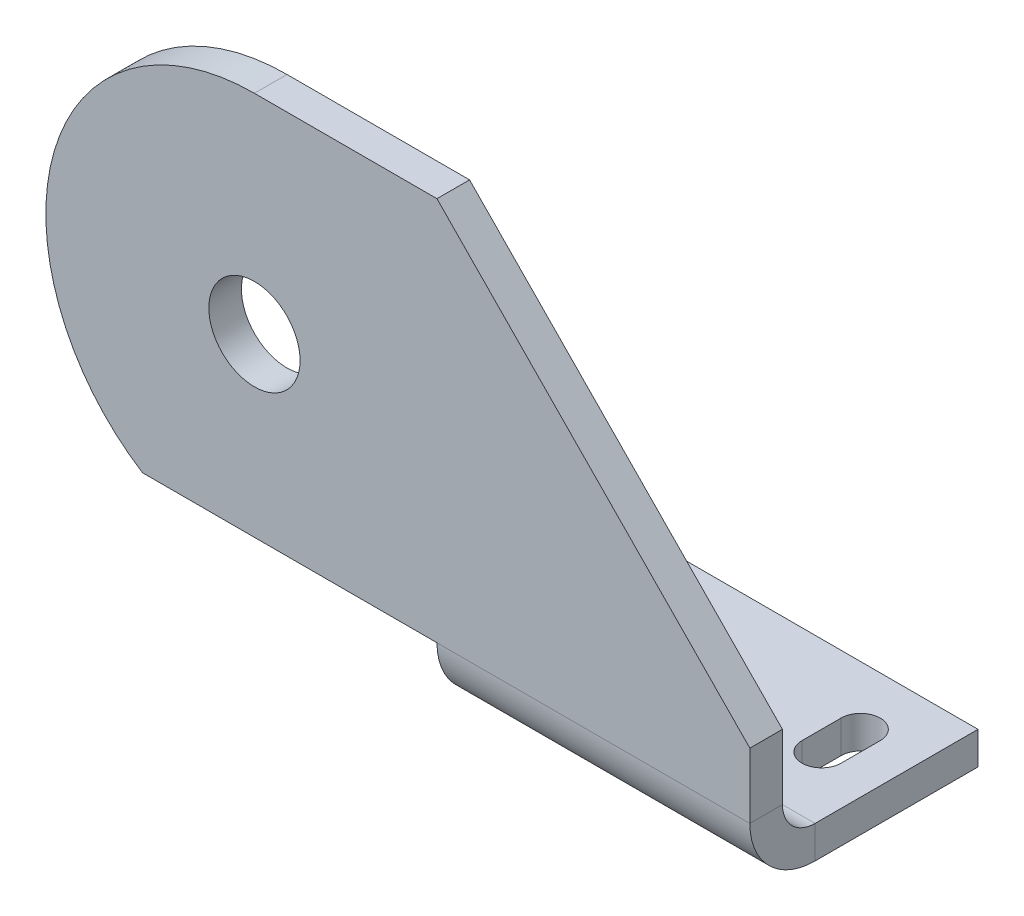
ISO-10303-21;
HEADER;
FILE_DESCRIPTION(('STEP AP214'),'2;1');
FILE_NAME('part.step','',(''),(''),'','','');
FILE_SCHEMA(('AUTOMOTIVE_DESIGN { 1 0 10303 214 1 1 1 1 }'));
ENDSEC;
DATA;
#1=APPLICATION_CONTEXT('core data for automotive mechanical design processes');
#2=APPLICATION_PROTOCOL_DEFINITION('international standard','automotive_design',2000,#1);
#3=PRODUCT_CONTEXT('',#1,'mechanical');
#4=PRODUCT('Part','Part','',(#3));
#5=PRODUCT_RELATED_PRODUCT_CATEGORY('part','',(#4));
#6=PRODUCT_DEFINITION_FORMATION('','',#4);
#7=PRODUCT_DEFINITION_CONTEXT('part definition',#1,'design');
#8=PRODUCT_DEFINITION('design','',#6,#7);
#9=PRODUCT_DEFINITION_SHAPE('','',#8);
#10=(LENGTH_UNIT() NAMED_UNIT(*) SI_UNIT(.MILLI.,.METRE.));
#11=(NAMED_UNIT(*) PLANE_ANGLE_UNIT() SI_UNIT($,.RADIAN.));
#12=(NAMED_UNIT(*) SI_UNIT($,.STERADIAN.) SOLID_ANGLE_UNIT());
#13=UNCERTAINTY_MEASURE_WITH_UNIT(LENGTH_MEASURE(1.E-05),#10,'distance_accuracy_value','');
#14=(GEOMETRIC_REPRESENTATION_CONTEXT(3) GLOBAL_UNCERTAINTY_ASSIGNED_CONTEXT((#13)) GLOBAL_UNIT_ASSIGNED_CONTEXT((#10,
#11,#12)) REPRESENTATION_CONTEXT('',''));
#15=CARTESIAN_POINT('',(0.,0.,0.));
#16=DIRECTION('',(0.,0.,1.));
#17=DIRECTION('',(1.,0.,0.));
#18=AXIS2_PLACEMENT_3D('',#15,#16,#17);
#19=CARTESIAN_POINT('',(-108.,0.,5.));
#20=DIRECTION('',(0.,0.,-1.));
#21=DIRECTION('',(-1.,0.,0.));
#22=AXIS2_PLACEMENT_3D('',#19,#20,#21);
#23=PLANE('',#22);
#24=CARTESIAN_POINT('',(-76.,32.,5.));
#25=DIRECTION('',(0.,0.,1.));
#26=DIRECTION('',(1.,0.,0.));
#27=AXIS2_PLACEMENT_3D('',#24,#25,#26);
#28=CIRCLE('',#27,7.);
#29=CARTESIAN_POINT('',(-69.,32.,5.));
#30=VERTEX_POINT('',#29);
#31=EDGE_CURVE('E187',#30,#30,#28,.T.);
#32=ORIENTED_EDGE('',*,*,#31,.F.);
#33=EDGE_LOOP('',(#32));
#34=FACE_BOUND('',#33,.T.);
#35=DIRECTION('',(0.699779834816443,-0.714358581375119,0.));
#36=VECTOR('',#35,1.);
#37=CARTESIAN_POINT('',(0.,15.,5.));
#38=LINE('',#37,#36);
#39=CARTESIAN_POINT('',(-48.,64.,5.));
#40=VERTEX_POINT('',#39);
#41=CARTESIAN_POINT('',(0.,15.,5.));
#42=VERTEX_POINT('',#41);
#43=EDGE_CURVE('E229',#40,#42,#38,.T.);
#44=ORIENTED_EDGE('',*,*,#43,.F.);
#45=DIRECTION('',(1.,0.,0.));
#46=VECTOR('',#45,1.);
#47=CARTESIAN_POINT('',(-108.,64.,5.));
#48=LINE('',#47,#46);
#49=CARTESIAN_POINT('',(-76.,64.,5.));
#50=VERTEX_POINT('',#49);
#51=EDGE_CURVE('E305',#50,#40,#48,.T.);
#52=ORIENTED_EDGE('',*,*,#51,.F.);
#53=CARTESIAN_POINT('',(-76.,32.,5.));
#54=DIRECTION('',(0.,0.,-1.));
#55=DIRECTION('',(1.,0.,0.));
#56=AXIS2_PLACEMENT_3D('',#53,#54,#55);
#57=CIRCLE('',#56,32.);
#58=CARTESIAN_POINT('',(-93.1755640373177,5.,5.));
#59=VERTEX_POINT('',#58);
#60=EDGE_CURVE('E248',#59,#50,#57,.T.);
#61=ORIENTED_EDGE('',*,*,#60,.F.);
#62=DIRECTION('',(1.,0.,0.));
#63=VECTOR('',#62,1.);
#64=CARTESIAN_POINT('',(-108.,5.,5.));
#65=LINE('',#64,#63);
#66=CARTESIAN_POINT('',(-48.,5.,5.));
#67=VERTEX_POINT('',#66);
#68=EDGE_CURVE('E289',#59,#67,#65,.T.);
#69=ORIENTED_EDGE('',*,*,#68,.T.);
#70=CARTESIAN_POINT('',(0.,5.,5.));
#71=VERTEX_POINT('',#70);
#72=EDGE_CURVE('E288',#67,#71,#65,.T.);
#73=ORIENTED_EDGE('',*,*,#72,.T.);
#74=DIRECTION('',(0.,1.,0.));
#75=VECTOR('',#74,1.);
#76=CARTESIAN_POINT('',(0.,0.,5.));
#77=LINE('',#76,#75);
#78=EDGE_CURVE('E267',#71,#42,#77,.T.);
#79=ORIENTED_EDGE('',*,*,#78,.T.);
#80=EDGE_LOOP('',(#44,#52,#61,#69,#73,#79));
#81=FACE_BOUND('',#80,.T.);
#82=ADVANCED_FACE('F38',(#34,#81),#23,.F.);
#83=CARTESIAN_POINT('',(-108.,0.,0.));
#84=DIRECTION('',(0.,0.,-1.));
#85=DIRECTION('',(-1.,0.,0.));
#86=AXIS2_PLACEMENT_3D('',#83,#84,#85);
#87=PLANE('',#86);
#88=CARTESIAN_POINT('',(-76.,32.,0.));
#89=DIRECTION('',(0.,0.,1.));
#90=DIRECTION('',(1.,0.,0.));
#91=AXIS2_PLACEMENT_3D('',#88,#89,#90);
#92=CIRCLE('',#91,7.);
#93=CARTESIAN_POINT('',(-69.,32.,0.));
#94=VERTEX_POINT('',#93);
#95=EDGE_CURVE('E194',#94,#94,#92,.T.);
#96=ORIENTED_EDGE('',*,*,#95,.T.);
#97=EDGE_LOOP('',(#96));
#98=FACE_BOUND('',#97,.T.);
#99=DIRECTION('',(1.,0.,0.));
#100=VECTOR('',#99,1.);
#101=CARTESIAN_POINT('',(-108.,64.,0.));
#102=LINE('',#101,#100);
#103=CARTESIAN_POINT('',(-76.,64.,0.));
#104=VERTEX_POINT('',#103);
#105=CARTESIAN_POINT('',(-48.,64.,0.));
#106=VERTEX_POINT('',#105);
#107=EDGE_CURVE('E302',#104,#106,#102,.T.);
#108=ORIENTED_EDGE('',*,*,#107,.T.);
#109=DIRECTION('',(0.699779834816443,-0.714358581375119,0.));
#110=VECTOR('',#109,1.);
#111=CARTESIAN_POINT('',(0.,15.,0.));
#112=LINE('',#111,#110);
#113=CARTESIAN_POINT('',(0.,15.,0.));
#114=VERTEX_POINT('',#113);
#115=EDGE_CURVE('E236',#106,#114,#112,.T.);
#116=ORIENTED_EDGE('',*,*,#115,.T.);
#117=DIRECTION('',(0.,1.,0.));
#118=VECTOR('',#117,1.);
#119=CARTESIAN_POINT('',(0.,0.,0.));
#120=LINE('',#119,#118);
#121=CARTESIAN_POINT('',(0.,5.,0.));
#122=VERTEX_POINT('',#121);
#123=EDGE_CURVE('E270',#122,#114,#120,.T.);
#124=ORIENTED_EDGE('',*,*,#123,.F.);
#125=DIRECTION('',(1.,0.,0.));
#126=VECTOR('',#125,1.);
#127=CARTESIAN_POINT('',(-108.,5.,0.));
#128=LINE('',#127,#126);
#129=CARTESIAN_POINT('',(-48.,5.,0.));
#130=VERTEX_POINT('',#129);
#131=EDGE_CURVE('E299',#130,#122,#128,.T.);
#132=ORIENTED_EDGE('',*,*,#131,.F.);
#133=CARTESIAN_POINT('',(-93.1755640373177,5.,0.));
#134=VERTEX_POINT('',#133);
#135=EDGE_CURVE('E300',#134,#130,#128,.T.);
#136=ORIENTED_EDGE('',*,*,#135,.F.);
#137=CARTESIAN_POINT('',(-76.,32.,0.));
#138=DIRECTION('',(0.,0.,-1.));
#139=DIRECTION('',(-1.,0.,0.));
#140=AXIS2_PLACEMENT_3D('',#137,#138,#139);
#141=CIRCLE('',#140,32.);
#142=EDGE_CURVE('E249',#134,#104,#141,.T.);
#143=ORIENTED_EDGE('',*,*,#142,.T.);
#144=EDGE_LOOP('',(#108,#116,#124,#132,#136,#143));
#145=FACE_BOUND('',#144,.T.);
#146=ADVANCED_FACE('F357',(#98,#145),#87,.T.);
#147=CARTESIAN_POINT('',(-108.,64.,0.));
#148=DIRECTION('',(0.,1.,0.));
#149=DIRECTION('',(0.,0.,1.));
#150=AXIS2_PLACEMENT_3D('',#147,#148,#149);
#151=PLANE('',#150);
#152=ORIENTED_EDGE('',*,*,#51,.T.);
#153=DIRECTION('',(0.,0.,1.));
#154=VECTOR('',#153,1.);
#155=CARTESIAN_POINT('',(-48.,64.,5.));
#156=LINE('',#155,#154);
#157=EDGE_CURVE('E241',#40,#106,#156,.F.);
#158=ORIENTED_EDGE('',*,*,#157,.T.);
#159=ORIENTED_EDGE('',*,*,#107,.F.);
#160=DIRECTION('',(0.,0.,1.));
#161=VECTOR('',#160,1.);
#162=CARTESIAN_POINT('',(-76.,64.,5.));
#163=LINE('',#162,#161);
#164=EDGE_CURVE('E244',#50,#104,#163,.F.);
#165=ORIENTED_EDGE('',*,*,#164,.F.);
#166=EDGE_LOOP('',(#152,#158,#159,#165));
#167=FACE_BOUND('',#166,.T.);
#168=ADVANCED_FACE('F362',(#167),#151,.T.);
#169=CARTESIAN_POINT('',(0.,5.,-5.));
#170=DIRECTION('',(1.,0.,0.));
#171=DIRECTION('',(0.,0.,-1.));
#172=AXIS2_PLACEMENT_3D('',#169,#170,#171);
#173=PLANE('',#172);
#174=ORIENTED_EDGE('',*,*,#123,.T.);
#175=DIRECTION('',(0.,0.,1.));
#176=VECTOR('',#175,1.);
#177=CARTESIAN_POINT('',(0.,15.,5.));
#178=LINE('',#177,#176);
#179=EDGE_CURVE('E239',#42,#114,#178,.F.);
#180=ORIENTED_EDGE('',*,*,#179,.F.);
#181=ORIENTED_EDGE('',*,*,#78,.F.);
#182=DIRECTION('',(0.,0.,-1.));
#183=VECTOR('',#182,1.);
#184=CARTESIAN_POINT('',(0.,5.,5.));
#185=LINE('',#184,#183);
#186=EDGE_CURVE('E308',#71,#122,#185,.T.);
#187=ORIENTED_EDGE('',*,*,#186,.T.);
#188=EDGE_LOOP('',(#174,#180,#181,#187));
#189=FACE_BOUND('',#188,.T.);
#190=ADVANCED_FACE('F330',(#189),#173,.T.);
#191=CARTESIAN_POINT('',(-48.,5.,5.));
#192=DIRECTION('',(0.,1.,0.));
#193=DIRECTION('',(0.,0.,1.));
#194=AXIS2_PLACEMENT_3D('',#191,#192,#193);
#195=PLANE('',#194);
#196=DIRECTION('',(0.,0.,1.));
#197=VECTOR('',#196,1.);
#198=CARTESIAN_POINT('',(-93.1755640373177,5.,5.));
#199=LINE('',#198,#197);
#200=EDGE_CURVE('E251',#59,#134,#199,.F.);
#201=ORIENTED_EDGE('',*,*,#200,.T.);
#202=ORIENTED_EDGE('',*,*,#135,.T.);
#203=DIRECTION('',(0.,0.,-1.));
#204=VECTOR('',#203,1.);
#205=CARTESIAN_POINT('',(-48.,5.,5.));
#206=LINE('',#205,#204);
#207=EDGE_CURVE('E258',#67,#130,#206,.T.);
#208=ORIENTED_EDGE('',*,*,#207,.F.);
#209=ORIENTED_EDGE('',*,*,#68,.F.);
#210=EDGE_LOOP('',(#201,#202,#208,#209));
#211=FACE_BOUND('',#210,.T.);
#212=ADVANCED_FACE('F340',(#211),#195,.F.);
#213=CARTESIAN_POINT('',(0.,0.,-5.));
#214=DIRECTION('',(1.,0.,0.));
#215=DIRECTION('',(0.,0.,-1.));
#216=AXIS2_PLACEMENT_3D('',#213,#214,#215);
#217=PLANE('',#216);
#218=DIRECTION('',(0.,-1.,0.));
#219=VECTOR('',#218,1.);
#220=CARTESIAN_POINT('',(0.,0.,-5.));
#221=LINE('',#220,#219);
#222=CARTESIAN_POINT('',(0.,0.,-5.));
#223=VERTEX_POINT('',#222);
#224=CARTESIAN_POINT('',(0.,-5.,-5.));
#225=VERTEX_POINT('',#224);
#226=EDGE_CURVE('E46',#223,#225,#221,.T.);
#227=ORIENTED_EDGE('',*,*,#226,.F.);
#228=CARTESIAN_POINT('',(0.,5.,-5.));
#229=DIRECTION('',(1.,0.,0.));
#230=DIRECTION('',(0.,0.,-1.));
#231=AXIS2_PLACEMENT_3D('',#228,#229,#230);
#232=CIRCLE('',#231,5.);
#233=EDGE_CURVE('E273',#223,#122,#232,.F.);
#234=ORIENTED_EDGE('',*,*,#233,.T.);
#235=ORIENTED_EDGE('',*,*,#186,.F.);
#236=CARTESIAN_POINT('',(0.,5.,-5.));
#237=DIRECTION('',(-1.,0.,0.));
#238=DIRECTION('',(0.,0.,1.));
#239=AXIS2_PLACEMENT_3D('',#236,#237,#238);
#240=CIRCLE('',#239,10.);
#241=EDGE_CURVE('E285',#225,#71,#240,.T.);
#242=ORIENTED_EDGE('',*,*,#241,.F.);
#243=EDGE_LOOP('',(#227,#234,#235,#242));
#244=FACE_BOUND('',#243,.T.);
#245=ADVANCED_FACE('F40',(#244),#217,.T.);
#246=CARTESIAN_POINT('',(0.,5.,5.));
#247=DIRECTION('',(1.,0.,0.));
#248=DIRECTION('',(0.,0.,-1.));
#249=AXIS2_PLACEMENT_3D('',#246,#247,#248);
#250=PLANE('',#249);
#251=DIRECTION('',(0.,0.,1.));
#252=VECTOR('',#251,1.);
#253=CARTESIAN_POINT('',(0.,0.,-30.));
#254=LINE('',#253,#252);
#255=CARTESIAN_POINT('',(0.,0.,-30.));
#256=VERTEX_POINT('',#255);
#257=EDGE_CURVE('E276',#256,#223,#254,.T.);
#258=ORIENTED_EDGE('',*,*,#257,.T.);
#259=ORIENTED_EDGE('',*,*,#226,.T.);
#260=DIRECTION('',(0.,0.,1.));
#261=VECTOR('',#260,1.);
#262=CARTESIAN_POINT('',(0.,-5.00000000000001,-30.));
#263=LINE('',#262,#261);
#264=CARTESIAN_POINT('',(0.,-5.00000000000001,-30.));
#265=VERTEX_POINT('',#264);
#266=EDGE_CURVE('E282',#265,#225,#263,.T.);
#267=ORIENTED_EDGE('',*,*,#266,.F.);
#268=DIRECTION('',(0.,1.,0.));
#269=VECTOR('',#268,1.);
#270=CARTESIAN_POINT('',(0.,-5.00000000000001,-30.));
#271=LINE('',#270,#269);
#272=EDGE_CURVE('E279',#265,#256,#271,.T.);
#273=ORIENTED_EDGE('',*,*,#272,.T.);
#274=EDGE_LOOP('',(#258,#259,#267,#273));
#275=FACE_BOUND('',#274,.T.);
#276=ADVANCED_FACE('F314',(#275),#250,.T.);
#277=CARTESIAN_POINT('',(-108.,5.,-5.));
#278=DIRECTION('',(1.,0.,0.));
#279=DIRECTION('',(0.,0.,-1.));
#280=AXIS2_PLACEMENT_3D('',#277,#278,#279);
#281=CYLINDRICAL_SURFACE('',#280,5.);
#282=CARTESIAN_POINT('',(-48.,5.,-5.));
#283=DIRECTION('',(1.,0.,0.));
#284=DIRECTION('',(0.,0.,-1.));
#285=AXIS2_PLACEMENT_3D('',#282,#283,#284);
#286=CIRCLE('',#285,5.);
#287=CARTESIAN_POINT('',(-48.,0.,-5.));
#288=VERTEX_POINT('',#287);
#289=EDGE_CURVE('E265',#130,#288,#286,.T.);
#290=ORIENTED_EDGE('',*,*,#289,.F.);
#291=ORIENTED_EDGE('',*,*,#131,.T.);
#292=ORIENTED_EDGE('',*,*,#233,.F.);
#293=DIRECTION('',(1.,0.,0.));
#294=VECTOR('',#293,1.);
#295=CARTESIAN_POINT('',(-108.,0.,-5.));
#296=LINE('',#295,#294);
#297=EDGE_CURVE('E297',#288,#223,#296,.T.);
#298=ORIENTED_EDGE('',*,*,#297,.F.);
#299=EDGE_LOOP('',(#290,#291,#292,#298));
#300=FACE_BOUND('',#299,.T.);
#301=ADVANCED_FACE('F354',(#300),#281,.F.);
#302=CARTESIAN_POINT('',(-108.,0.,-30.));
#303=DIRECTION('',(0.,1.,0.));
#304=DIRECTION('',(0.,0.,1.));
#305=AXIS2_PLACEMENT_3D('',#302,#303,#304);
#306=PLANE('',#305);
#307=CARTESIAN_POINT('',(-9.,0.,-21.));
#308=DIRECTION('',(0.,1.,0.));
#309=DIRECTION('',(0.,0.,1.));
#310=AXIS2_PLACEMENT_3D('',#307,#308,#309);
#311=CIRCLE('',#310,3.);
#312=CARTESIAN_POINT('',(-6.,0.,-21.));
#313=VERTEX_POINT('',#312);
#314=CARTESIAN_POINT('',(-12.,0.,-21.));
#315=VERTEX_POINT('',#314);
#316=EDGE_CURVE('E53',#313,#315,#311,.T.);
#317=ORIENTED_EDGE('',*,*,#316,.F.);
#318=DIRECTION('',(0.,0.,-1.));
#319=VECTOR('',#318,1.);
#320=CARTESIAN_POINT('',(-6.,0.,-21.));
#321=LINE('',#320,#319);
#322=CARTESIAN_POINT('',(-6.,0.,-15.));
#323=VERTEX_POINT('',#322);
#324=EDGE_CURVE('E181',#323,#313,#321,.T.);
#325=ORIENTED_EDGE('',*,*,#324,.F.);
#326=CARTESIAN_POINT('',(-9.,0.,-15.));
#327=DIRECTION('',(0.,1.,0.));
#328=DIRECTION('',(0.,0.,1.));
#329=AXIS2_PLACEMENT_3D('',#326,#327,#328);
#330=CIRCLE('',#329,3.);
#331=CARTESIAN_POINT('',(-12.,0.,-15.));
#332=VERTEX_POINT('',#331);
#333=EDGE_CURVE('E184',#332,#323,#330,.T.);
#334=ORIENTED_EDGE('',*,*,#333,.F.);
#335=DIRECTION('',(0.,0.,1.));
#336=VECTOR('',#335,1.);
#337=CARTESIAN_POINT('',(-12.,0.,-21.));
#338=LINE('',#337,#336);
#339=EDGE_CURVE('E193',#315,#332,#338,.T.);
#340=ORIENTED_EDGE('',*,*,#339,.F.);
#341=EDGE_LOOP('',(#317,#325,#334,#340));
#342=FACE_BOUND('',#341,.T.);
#343=CARTESIAN_POINT('',(-39.,0.,-21.));
#344=DIRECTION('',(0.,1.,0.));
#345=DIRECTION('',(0.,0.,1.));
#346=AXIS2_PLACEMENT_3D('',#343,#344,#345);
#347=CIRCLE('',#346,3.);
#348=CARTESIAN_POINT('',(-36.,0.,-21.));
#349=VERTEX_POINT('',#348);
#350=CARTESIAN_POINT('',(-42.,0.,-21.));
#351=VERTEX_POINT('',#350);
#352=EDGE_CURVE('E200',#349,#351,#347,.T.);
#353=ORIENTED_EDGE('',*,*,#352,.F.);
#354=DIRECTION('',(0.,0.,-1.));
#355=VECTOR('',#354,1.);
#356=CARTESIAN_POINT('',(-36.,0.,-21.));
#357=LINE('',#356,#355);
#358=CARTESIAN_POINT('',(-36.,0.,-15.));
#359=VERTEX_POINT('',#358);
#360=EDGE_CURVE('E208',#359,#349,#357,.T.);
#361=ORIENTED_EDGE('',*,*,#360,.F.);
#362=CARTESIAN_POINT('',(-39.,0.,-15.));
#363=DIRECTION('',(0.,1.,0.));
#364=DIRECTION('',(0.,0.,1.));
#365=AXIS2_PLACEMENT_3D('',#362,#363,#364);
#366=CIRCLE('',#365,3.);
#367=CARTESIAN_POINT('',(-42.,0.,-15.));
#368=VERTEX_POINT('',#367);
#369=EDGE_CURVE('E222',#368,#359,#366,.T.);
#370=ORIENTED_EDGE('',*,*,#369,.F.);
#371=DIRECTION('',(0.,0.,1.));
#372=VECTOR('',#371,1.);
#373=CARTESIAN_POINT('',(-42.,0.,-21.));
#374=LINE('',#373,#372);
#375=EDGE_CURVE('E219',#351,#368,#374,.T.);
#376=ORIENTED_EDGE('',*,*,#375,.F.);
#377=EDGE_LOOP('',(#353,#361,#370,#376));
#378=FACE_BOUND('',#377,.T.);
#379=DIRECTION('',(0.,0.,-1.));
#380=VECTOR('',#379,1.);
#381=CARTESIAN_POINT('',(-48.,0.,-30.));
#382=LINE('',#381,#380);
#383=CARTESIAN_POINT('',(-48.,0.,-30.));
#384=VERTEX_POINT('',#383);
#385=EDGE_CURVE('E261',#288,#384,#382,.T.);
#386=ORIENTED_EDGE('',*,*,#385,.F.);
#387=ORIENTED_EDGE('',*,*,#297,.T.);
#388=ORIENTED_EDGE('',*,*,#257,.F.);
#389=DIRECTION('',(1.,0.,0.));
#390=VECTOR('',#389,1.);
#391=CARTESIAN_POINT('',(-108.,0.,-30.));
#392=LINE('',#391,#390);
#393=EDGE_CURVE('E295',#384,#256,#392,.T.);
#394=ORIENTED_EDGE('',*,*,#393,.F.);
#395=EDGE_LOOP('',(#386,#387,#388,#394));
#396=FACE_BOUND('',#395,.T.);
#397=ADVANCED_FACE('F351',(#342,#378,#396),#306,.T.);
#398=CARTESIAN_POINT('',(-108.,-5.00000000000001,-30.));
#399=DIRECTION('',(0.,0.,-1.));
#400=DIRECTION('',(-1.,0.,0.));
#401=AXIS2_PLACEMENT_3D('',#398,#399,#400);
#402=PLANE('',#401);
#403=DIRECTION('',(0.,-1.,0.));
#404=VECTOR('',#403,1.);
#405=CARTESIAN_POINT('',(-48.,-5.00000000000001,-30.));
#406=LINE('',#405,#404);
#407=CARTESIAN_POINT('',(-48.,-5.00000000000001,-30.));
#408=VERTEX_POINT('',#407);
#409=EDGE_CURVE('E255',#384,#408,#406,.T.);
#410=ORIENTED_EDGE('',*,*,#409,.F.);
#411=ORIENTED_EDGE('',*,*,#393,.T.);
#412=ORIENTED_EDGE('',*,*,#272,.F.);
#413=DIRECTION('',(1.,0.,0.));
#414=VECTOR('',#413,1.);
#415=CARTESIAN_POINT('',(-108.,-5.00000000000001,-30.));
#416=LINE('',#415,#414);
#417=EDGE_CURVE('E293',#408,#265,#416,.T.);
#418=ORIENTED_EDGE('',*,*,#417,.F.);
#419=EDGE_LOOP('',(#410,#411,#412,#418));
#420=FACE_BOUND('',#419,.T.);
#421=ADVANCED_FACE('F347',(#420),#402,.T.);
#422=CARTESIAN_POINT('',(-108.,-5.00000000000001,-30.));
#423=DIRECTION('',(0.,1.,0.));
#424=DIRECTION('',(0.,0.,1.));
#425=AXIS2_PLACEMENT_3D('',#422,#423,#424);
#426=PLANE('',#425);
#427=DIRECTION('',(0.,0.,-1.));
#428=VECTOR('',#427,1.);
#429=CARTESIAN_POINT('',(-6.,-5.00000000000001,-21.));
#430=LINE('',#429,#428);
#431=CARTESIAN_POINT('',(-6.,-5.,-15.));
#432=VERTEX_POINT('',#431);
#433=CARTESIAN_POINT('',(-6.,-5.00000000000001,-21.));
#434=VERTEX_POINT('',#433);
#435=EDGE_CURVE('E171',#432,#434,#430,.T.);
#436=ORIENTED_EDGE('',*,*,#435,.T.);
#437=CARTESIAN_POINT('',(-9.,-5.00000000000001,-21.));
#438=DIRECTION('',(0.,1.,0.));
#439=DIRECTION('',(0.,0.,1.));
#440=AXIS2_PLACEMENT_3D('',#437,#438,#439);
#441=CIRCLE('',#440,3.);
#442=CARTESIAN_POINT('',(-12.,-5.00000000000001,-21.));
#443=VERTEX_POINT('',#442);
#444=EDGE_CURVE('E165',#434,#443,#441,.T.);
#445=ORIENTED_EDGE('',*,*,#444,.T.);
#446=DIRECTION('',(0.,0.,1.));
#447=VECTOR('',#446,1.);
#448=CARTESIAN_POINT('',(-12.,-5.00000000000001,-21.));
#449=LINE('',#448,#447);
#450=CARTESIAN_POINT('',(-12.,-5.,-15.));
#451=VERTEX_POINT('',#450);
#452=EDGE_CURVE('E174',#443,#451,#449,.T.);
#453=ORIENTED_EDGE('',*,*,#452,.T.);
#454=CARTESIAN_POINT('',(-9.,-5.,-15.));
#455=DIRECTION('',(0.,1.,0.));
#456=DIRECTION('',(0.,0.,1.));
#457=AXIS2_PLACEMENT_3D('',#454,#455,#456);
#458=CIRCLE('',#457,3.);
#459=EDGE_CURVE('E61',#451,#432,#458,.T.);
#460=ORIENTED_EDGE('',*,*,#459,.T.);
#461=EDGE_LOOP('',(#436,#445,#453,#460));
#462=FACE_BOUND('',#461,.T.);
#463=DIRECTION('',(0.,0.,-1.));
#464=VECTOR('',#463,1.);
#465=CARTESIAN_POINT('',(-36.,-5.00000000000001,-21.));
#466=LINE('',#465,#464);
#467=CARTESIAN_POINT('',(-36.,-5.,-15.));
#468=VERTEX_POINT('',#467);
#469=CARTESIAN_POINT('',(-36.,-5.00000000000001,-21.));
#470=VERTEX_POINT('',#469);
#471=EDGE_CURVE('E214',#468,#470,#466,.T.);
#472=ORIENTED_EDGE('',*,*,#471,.T.);
#473=CARTESIAN_POINT('',(-39.,-5.00000000000001,-21.));
#474=DIRECTION('',(0.,1.,0.));
#475=DIRECTION('',(0.,0.,1.));
#476=AXIS2_PLACEMENT_3D('',#473,#474,#475);
#477=CIRCLE('',#476,3.);
#478=CARTESIAN_POINT('',(-42.,-5.00000000000001,-21.));
#479=VERTEX_POINT('',#478);
#480=EDGE_CURVE('E204',#470,#479,#477,.T.);
#481=ORIENTED_EDGE('',*,*,#480,.T.);
#482=DIRECTION('',(0.,0.,1.));
#483=VECTOR('',#482,1.);
#484=CARTESIAN_POINT('',(-42.,-5.00000000000001,-21.));
#485=LINE('',#484,#483);
#486=CARTESIAN_POINT('',(-42.,-5.,-15.));
#487=VERTEX_POINT('',#486);
#488=EDGE_CURVE('E207',#479,#487,#485,.T.);
#489=ORIENTED_EDGE('',*,*,#488,.T.);
#490=CARTESIAN_POINT('',(-39.,-5.,-15.));
#491=DIRECTION('',(0.,1.,0.));
#492=DIRECTION('',(0.,0.,1.));
#493=AXIS2_PLACEMENT_3D('',#490,#491,#492);
#494=CIRCLE('',#493,3.);
#495=EDGE_CURVE('E211',#487,#468,#494,.T.);
#496=ORIENTED_EDGE('',*,*,#495,.T.);
#497=EDGE_LOOP('',(#472,#481,#489,#496));
#498=FACE_BOUND('',#497,.T.);
#499=DIRECTION('',(1.,0.,0.));
#500=VECTOR('',#499,1.);
#501=CARTESIAN_POINT('',(-108.,-5.,-5.));
#502=LINE('',#501,#500);
#503=CARTESIAN_POINT('',(-48.,-5.00000000000001,-5.));
#504=VERTEX_POINT('',#503);
#505=EDGE_CURVE('E291',#504,#225,#502,.T.);
#506=ORIENTED_EDGE('',*,*,#505,.F.);
#507=DIRECTION('',(0.,0.,-1.));
#508=VECTOR('',#507,1.);
#509=CARTESIAN_POINT('',(-48.,-5.00000000000001,5.));
#510=LINE('',#509,#508);
#511=EDGE_CURVE('E257',#504,#408,#510,.T.);
#512=ORIENTED_EDGE('',*,*,#511,.T.);
#513=ORIENTED_EDGE('',*,*,#417,.T.);
#514=ORIENTED_EDGE('',*,*,#266,.T.);
#515=EDGE_LOOP('',(#506,#512,#513,#514));
#516=FACE_BOUND('',#515,.T.);
#517=ADVANCED_FACE('F178',(#462,#498,#516),#426,.F.);
#518=CARTESIAN_POINT('',(-108.,5.,-5.));
#519=DIRECTION('',(1.,0.,0.));
#520=DIRECTION('',(0.,0.,-1.));
#521=AXIS2_PLACEMENT_3D('',#518,#519,#520);
#522=CYLINDRICAL_SURFACE('',#521,10.);
#523=ORIENTED_EDGE('',*,*,#72,.F.);
#524=CARTESIAN_POINT('',(-48.,5.,-5.));
#525=DIRECTION('',(1.,0.,0.));
#526=DIRECTION('',(0.,0.,-1.));
#527=AXIS2_PLACEMENT_3D('',#524,#525,#526);
#528=CIRCLE('',#527,10.);
#529=EDGE_CURVE('E12',#67,#504,#528,.T.);
#530=ORIENTED_EDGE('',*,*,#529,.T.);
#531=ORIENTED_EDGE('',*,*,#505,.T.);
#532=ORIENTED_EDGE('',*,*,#241,.T.);
#533=EDGE_LOOP('',(#523,#530,#531,#532));
#534=FACE_BOUND('',#533,.T.);
#535=ADVANCED_FACE('F327',(#534),#522,.T.);
#536=CARTESIAN_POINT('',(-48.,-5.00000000000001,5.));
#537=DIRECTION('',(1.,0.,0.));
#538=DIRECTION('',(0.,0.,-1.));
#539=AXIS2_PLACEMENT_3D('',#536,#537,#538);
#540=PLANE('',#539);
#541=ORIENTED_EDGE('',*,*,#289,.T.);
#542=ORIENTED_EDGE('',*,*,#385,.T.);
#543=ORIENTED_EDGE('',*,*,#409,.T.);
#544=ORIENTED_EDGE('',*,*,#511,.F.);
#545=ORIENTED_EDGE('',*,*,#529,.F.);
#546=ORIENTED_EDGE('',*,*,#207,.T.);
#547=EDGE_LOOP('',(#541,#542,#543,#544,#545,#546));
#548=FACE_BOUND('',#547,.T.);
#549=ADVANCED_FACE('F344',(#548),#540,.F.);
#550=CARTESIAN_POINT('',(-76.,32.,5.));
#551=DIRECTION('',(0.,0.,-1.));
#552=DIRECTION('',(-1.,0.,0.));
#553=AXIS2_PLACEMENT_3D('',#550,#551,#552);
#554=CYLINDRICAL_SURFACE('',#553,32.);
#555=ORIENTED_EDGE('',*,*,#200,.F.);
#556=ORIENTED_EDGE('',*,*,#60,.T.);
#557=ORIENTED_EDGE('',*,*,#164,.T.);
#558=ORIENTED_EDGE('',*,*,#142,.F.);
#559=EDGE_LOOP('',(#555,#556,#557,#558));
#560=FACE_BOUND('',#559,.T.);
#561=ADVANCED_FACE('F365',(#560),#554,.T.);
#562=CARTESIAN_POINT('',(0.,15.,5.));
#563=DIRECTION('',(0.714358581375119,0.699779834816443,0.));
#564=DIRECTION('',(0.699779834816443,-0.714358581375119,0.));
#565=AXIS2_PLACEMENT_3D('',#562,#563,#564);
#566=PLANE('',#565);
#567=ORIENTED_EDGE('',*,*,#157,.F.);
#568=ORIENTED_EDGE('',*,*,#43,.T.);
#569=ORIENTED_EDGE('',*,*,#179,.T.);
#570=ORIENTED_EDGE('',*,*,#115,.F.);
#571=EDGE_LOOP('',(#567,#568,#569,#570));
#572=FACE_BOUND('',#571,.T.);
#573=ADVANCED_FACE('F360',(#572),#566,.T.);
#574=CARTESIAN_POINT('',(-39.,-5.00000000000001,-21.));
#575=DIRECTION('',(0.,1.,0.));
#576=DIRECTION('',(0.,0.,1.));
#577=AXIS2_PLACEMENT_3D('',#574,#575,#576);
#578=CYLINDRICAL_SURFACE('',#577,3.);
#579=ORIENTED_EDGE('',*,*,#352,.T.);
#580=DIRECTION('',(0.,1.,0.));
#581=VECTOR('',#580,1.);
#582=CARTESIAN_POINT('',(-42.,-5.00000000000001,-21.));
#583=LINE('',#582,#581);
#584=EDGE_CURVE('E217',#479,#351,#583,.T.);
#585=ORIENTED_EDGE('',*,*,#584,.F.);
#586=ORIENTED_EDGE('',*,*,#480,.F.);
#587=DIRECTION('',(0.,1.,0.));
#588=VECTOR('',#587,1.);
#589=CARTESIAN_POINT('',(-36.,-5.00000000000001,-21.));
#590=LINE('',#589,#588);
#591=EDGE_CURVE('E227',#470,#349,#590,.T.);
#592=ORIENTED_EDGE('',*,*,#591,.T.);
#593=EDGE_LOOP('',(#579,#585,#586,#592));
#594=FACE_BOUND('',#593,.T.);
#595=ADVANCED_FACE('F372',(#594),#578,.F.);
#596=CARTESIAN_POINT('',(-36.,-5.00000000000001,-21.));
#597=DIRECTION('',(1.,0.,0.));
#598=DIRECTION('',(0.,0.,-1.));
#599=AXIS2_PLACEMENT_3D('',#596,#597,#598);
#600=PLANE('',#599);
#601=ORIENTED_EDGE('',*,*,#360,.T.);
#602=ORIENTED_EDGE('',*,*,#591,.F.);
#603=ORIENTED_EDGE('',*,*,#471,.F.);
#604=DIRECTION('',(0.,1.,0.));
#605=VECTOR('',#604,1.);
#606=CARTESIAN_POINT('',(-36.,-5.,-15.));
#607=LINE('',#606,#605);
#608=EDGE_CURVE('E230',#468,#359,#607,.T.);
#609=ORIENTED_EDGE('',*,*,#608,.T.);
#610=EDGE_LOOP('',(#601,#602,#603,#609));
#611=FACE_BOUND('',#610,.T.);
#612=ADVANCED_FACE('F425',(#611),#600,.F.);
#613=CARTESIAN_POINT('',(-39.,-5.,-15.));
#614=DIRECTION('',(0.,1.,0.));
#615=DIRECTION('',(0.,0.,1.));
#616=AXIS2_PLACEMENT_3D('',#613,#614,#615);
#617=CYLINDRICAL_SURFACE('',#616,3.);
#618=ORIENTED_EDGE('',*,*,#369,.T.);
#619=ORIENTED_EDGE('',*,*,#608,.F.);
#620=ORIENTED_EDGE('',*,*,#495,.F.);
#621=DIRECTION('',(0.,1.,0.));
#622=VECTOR('',#621,1.);
#623=CARTESIAN_POINT('',(-42.,-5.,-15.));
#624=LINE('',#623,#622);
#625=EDGE_CURVE('E232',#487,#368,#624,.T.);
#626=ORIENTED_EDGE('',*,*,#625,.T.);
#627=EDGE_LOOP('',(#618,#619,#620,#626));
#628=FACE_BOUND('',#627,.T.);
#629=ADVANCED_FACE('F427',(#628),#617,.F.);
#630=CARTESIAN_POINT('',(-42.,-5.00000000000001,-21.));
#631=DIRECTION('',(-1.,0.,0.));
#632=DIRECTION('',(0.,0.,1.));
#633=AXIS2_PLACEMENT_3D('',#630,#631,#632);
#634=PLANE('',#633);
#635=ORIENTED_EDGE('',*,*,#375,.T.);
#636=ORIENTED_EDGE('',*,*,#625,.F.);
#637=ORIENTED_EDGE('',*,*,#488,.F.);
#638=ORIENTED_EDGE('',*,*,#584,.T.);
#639=EDGE_LOOP('',(#635,#636,#637,#638));
#640=FACE_BOUND('',#639,.T.);
#641=ADVANCED_FACE('F421',(#640),#634,.F.);
#642=CARTESIAN_POINT('',(-9.,-5.00000000000001,-21.));
#643=DIRECTION('',(0.,1.,0.));
#644=DIRECTION('',(0.,0.,1.));
#645=AXIS2_PLACEMENT_3D('',#642,#643,#644);
#646=CYLINDRICAL_SURFACE('',#645,3.);
#647=ORIENTED_EDGE('',*,*,#316,.T.);
#648=DIRECTION('',(0.,1.,0.));
#649=VECTOR('',#648,1.);
#650=CARTESIAN_POINT('',(-12.,-5.00000000000001,-21.));
#651=LINE('',#650,#649);
#652=EDGE_CURVE('E161',#443,#315,#651,.T.);
#653=ORIENTED_EDGE('',*,*,#652,.F.);
#654=ORIENTED_EDGE('',*,*,#444,.F.);
#655=DIRECTION('',(0.,1.,0.));
#656=VECTOR('',#655,1.);
#657=CARTESIAN_POINT('',(-6.,-5.00000000000001,-21.));
#658=LINE('',#657,#656);
#659=EDGE_CURVE('E198',#434,#313,#658,.T.);
#660=ORIENTED_EDGE('',*,*,#659,.T.);
#661=EDGE_LOOP('',(#647,#653,#654,#660));
#662=FACE_BOUND('',#661,.T.);
#663=ADVANCED_FACE('F163',(#662),#646,.F.);
#664=CARTESIAN_POINT('',(-6.,-5.00000000000001,-21.));
#665=DIRECTION('',(1.,0.,0.));
#666=DIRECTION('',(0.,0.,-1.));
#667=AXIS2_PLACEMENT_3D('',#664,#665,#666);
#668=PLANE('',#667);
#669=ORIENTED_EDGE('',*,*,#324,.T.);
#670=ORIENTED_EDGE('',*,*,#659,.F.);
#671=ORIENTED_EDGE('',*,*,#435,.F.);
#672=DIRECTION('',(0.,1.,0.));
#673=VECTOR('',#672,1.);
#674=CARTESIAN_POINT('',(-6.,-5.,-15.));
#675=LINE('',#674,#673);
#676=EDGE_CURVE('E201',#432,#323,#675,.T.);
#677=ORIENTED_EDGE('',*,*,#676,.T.);
#678=EDGE_LOOP('',(#669,#670,#671,#677));
#679=FACE_BOUND('',#678,.T.);
#680=ADVANCED_FACE('F470',(#679),#668,.F.);
#681=CARTESIAN_POINT('',(-9.,-5.,-15.));
#682=DIRECTION('',(0.,1.,0.));
#683=DIRECTION('',(0.,0.,1.));
#684=AXIS2_PLACEMENT_3D('',#681,#682,#683);
#685=CYLINDRICAL_SURFACE('',#684,3.);
#686=ORIENTED_EDGE('',*,*,#333,.T.);
#687=ORIENTED_EDGE('',*,*,#676,.F.);
#688=ORIENTED_EDGE('',*,*,#459,.F.);
#689=DIRECTION('',(0.,1.,0.));
#690=VECTOR('',#689,1.);
#691=CARTESIAN_POINT('',(-12.,-5.,-15.));
#692=LINE('',#691,#690);
#693=EDGE_CURVE('E170',#451,#332,#692,.T.);
#694=ORIENTED_EDGE('',*,*,#693,.T.);
#695=EDGE_LOOP('',(#686,#687,#688,#694));
#696=FACE_BOUND('',#695,.T.);
#697=ADVANCED_FACE('F479',(#696),#685,.F.);
#698=CARTESIAN_POINT('',(-12.,-5.00000000000001,-21.));
#699=DIRECTION('',(-1.,0.,0.));
#700=DIRECTION('',(0.,0.,1.));
#701=AXIS2_PLACEMENT_3D('',#698,#699,#700);
#702=PLANE('',#701);
#703=ORIENTED_EDGE('',*,*,#339,.T.);
#704=ORIENTED_EDGE('',*,*,#693,.F.);
#705=ORIENTED_EDGE('',*,*,#452,.F.);
#706=ORIENTED_EDGE('',*,*,#652,.T.);
#707=EDGE_LOOP('',(#703,#704,#705,#706));
#708=FACE_BOUND('',#707,.T.);
#709=ADVANCED_FACE('F175',(#708),#702,.F.);
#710=CARTESIAN_POINT('',(-76.,32.,0.));
#711=DIRECTION('',(0.,0.,1.));
#712=DIRECTION('',(1.,0.,0.));
#713=AXIS2_PLACEMENT_3D('',#710,#711,#712);
#714=CYLINDRICAL_SURFACE('',#713,7.);
#715=ORIENTED_EDGE('',*,*,#95,.F.);
#716=EDGE_LOOP('',(#715));
#717=FACE_BOUND('',#716,.T.);
#718=ORIENTED_EDGE('',*,*,#31,.T.);
#719=EDGE_LOOP('',(#718));
#720=FACE_BOUND('',#719,.T.);
#721=ADVANCED_FACE('F497',(#717,#720),#714,.F.);
#722=CLOSED_SHELL('',(#82,#146,#168,#190,#212,#245,#276,#301,#397,#421,#517,#535,#549,#561,#573,
#595,#612,#629,#641,#663,#680,#697,#709,#721));
#723=MANIFOLD_SOLID_BREP('B2',#722);
#724=ADVANCED_BREP_SHAPE_REPRESENTATION('',(#18,#723),#14);
#725=SHAPE_DEFINITION_REPRESENTATION(#9,#724);
ENDSEC;
END-ISO-10303-21;
